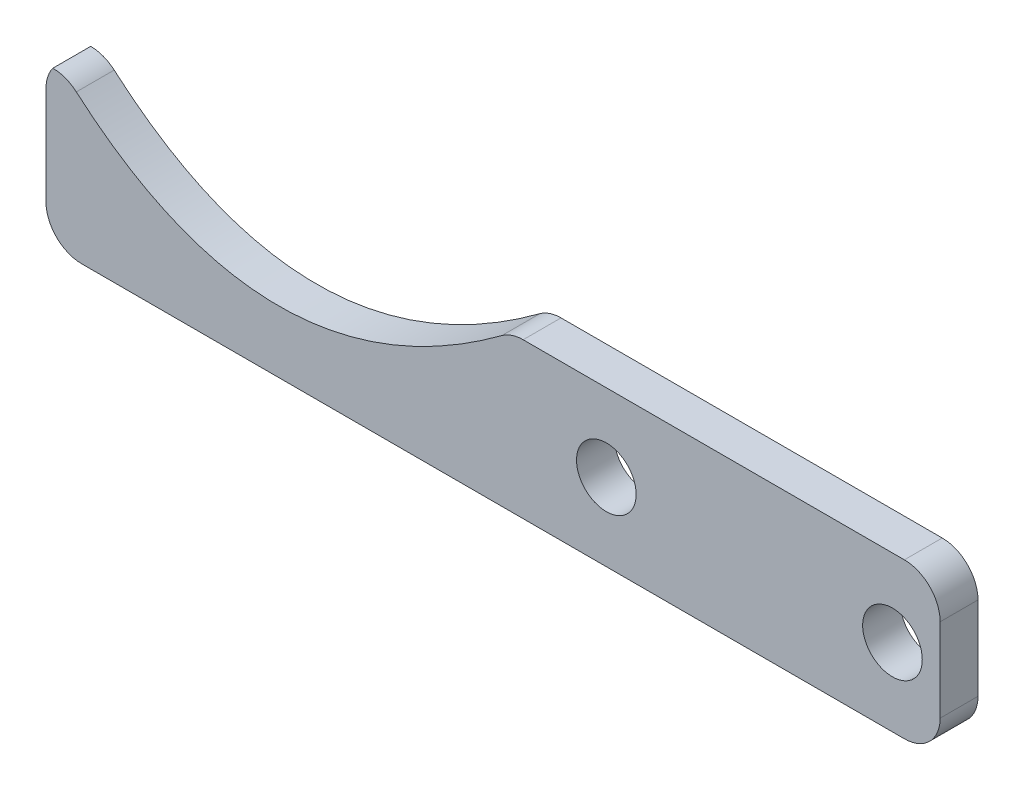
ISO-10303-21;
HEADER;
FILE_DESCRIPTION(('STEP AP214'),'2;1');
FILE_NAME('part.step','',(''),(''),'','','');
FILE_SCHEMA(('AUTOMOTIVE_DESIGN { 1 0 10303 214 1 1 1 1 }'));
ENDSEC;
DATA;
#1=APPLICATION_CONTEXT('core data for automotive mechanical design processes');
#2=APPLICATION_PROTOCOL_DEFINITION('international standard','automotive_design',2000,#1);
#3=PRODUCT_CONTEXT('',#1,'mechanical');
#4=PRODUCT('Part','Part','',(#3));
#5=PRODUCT_RELATED_PRODUCT_CATEGORY('part','',(#4));
#6=PRODUCT_DEFINITION_FORMATION('','',#4);
#7=PRODUCT_DEFINITION_CONTEXT('part definition',#1,'design');
#8=PRODUCT_DEFINITION('design','',#6,#7);
#9=PRODUCT_DEFINITION_SHAPE('','',#8);
#10=(LENGTH_UNIT() NAMED_UNIT(*) SI_UNIT(.MILLI.,.METRE.));
#11=(NAMED_UNIT(*) PLANE_ANGLE_UNIT() SI_UNIT($,.RADIAN.));
#12=(NAMED_UNIT(*) SI_UNIT($,.STERADIAN.) SOLID_ANGLE_UNIT());
#13=UNCERTAINTY_MEASURE_WITH_UNIT(LENGTH_MEASURE(1.E-05),#10,'distance_accuracy_value','');
#14=(GEOMETRIC_REPRESENTATION_CONTEXT(3) GLOBAL_UNCERTAINTY_ASSIGNED_CONTEXT((#13)) GLOBAL_UNIT_ASSIGNED_CONTEXT((#10,
#11,#12)) REPRESENTATION_CONTEXT('',''));
#15=CARTESIAN_POINT('',(0.,0.,0.));
#16=DIRECTION('',(0.,0.,1.));
#17=DIRECTION('',(1.,0.,0.));
#18=AXIS2_PLACEMENT_3D('',#15,#16,#17);
#19=CARTESIAN_POINT('',(37.5,6.49999999999999,3.175));
#20=DIRECTION('',(0.,0.,-1.));
#21=DIRECTION('',(-1.,0.,0.));
#22=AXIS2_PLACEMENT_3D('',#19,#20,#21);
#23=PLANE('',#22);
#24=CARTESIAN_POINT('',(33.5,0.,3.175));
#25=DIRECTION('',(0.,0.,1.));
#26=DIRECTION('',(1.,0.,0.));
#27=AXIS2_PLACEMENT_3D('',#24,#25,#26);
#28=CIRCLE('',#27,2.5);
#29=CARTESIAN_POINT('',(36.,0.,3.175));
#30=VERTEX_POINT('',#29);
#31=EDGE_CURVE('E285',#30,#30,#28,.T.);
#32=ORIENTED_EDGE('',*,*,#31,.F.);
#33=EDGE_LOOP('',(#32));
#34=FACE_BOUND('',#33,.T.);
#35=DIRECTION('',(1.,0.,0.));
#36=VECTOR('',#35,1.);
#37=CARTESIAN_POINT('',(-37.5,-6.50000000000001,3.175));
#38=LINE('',#37,#36);
#39=CARTESIAN_POINT('',(-34.5,-6.50000000000001,3.175));
#40=VERTEX_POINT('',#39);
#41=CARTESIAN_POINT('',(34.5,-6.50000000000001,3.175));
#42=VERTEX_POINT('',#41);
#43=EDGE_CURVE('E254',#40,#42,#38,.T.);
#44=ORIENTED_EDGE('',*,*,#43,.T.);
#45=CARTESIAN_POINT('',(34.5,-3.50000000000001,3.175));
#46=DIRECTION('',(0.,0.,-1.));
#47=DIRECTION('',(-1.,0.,0.));
#48=AXIS2_PLACEMENT_3D('',#45,#46,#47);
#49=CIRCLE('',#48,3.);
#50=CARTESIAN_POINT('',(37.5,-3.50000000000001,3.175));
#51=VERTEX_POINT('',#50);
#52=EDGE_CURVE('E225',#42,#51,#49,.F.);
#53=ORIENTED_EDGE('',*,*,#52,.T.);
#54=DIRECTION('',(0.,1.,0.));
#55=VECTOR('',#54,1.);
#56=CARTESIAN_POINT('',(37.5,-6.50000000000001,3.175));
#57=LINE('',#56,#55);
#58=CARTESIAN_POINT('',(37.5,3.49999999999999,3.175));
#59=VERTEX_POINT('',#58);
#60=EDGE_CURVE('E248',#51,#59,#57,.T.);
#61=ORIENTED_EDGE('',*,*,#60,.T.);
#62=CARTESIAN_POINT('',(34.5,3.49999999999999,3.175));
#63=DIRECTION('',(0.,0.,-1.));
#64=DIRECTION('',(-1.,0.,0.));
#65=AXIS2_PLACEMENT_3D('',#62,#63,#64);
#66=CIRCLE('',#65,3.);
#67=CARTESIAN_POINT('',(34.5,6.49999999999999,3.175));
#68=VERTEX_POINT('',#67);
#69=EDGE_CURVE('E48',#59,#68,#66,.F.);
#70=ORIENTED_EDGE('',*,*,#69,.T.);
#71=DIRECTION('',(-1.,0.,0.));
#72=VECTOR('',#71,1.);
#73=CARTESIAN_POINT('',(-37.5,6.50000000000001,3.175));
#74=LINE('',#73,#72);
#75=CARTESIAN_POINT('',(2.5234057065276,6.5,3.175));
#76=VERTEX_POINT('',#75);
#77=EDGE_CURVE('E291',#68,#76,#74,.T.);
#78=ORIENTED_EDGE('',*,*,#77,.T.);
#79=CARTESIAN_POINT('',(2.5234057065276,3.5,3.175));
#80=DIRECTION('',(0.,0.,-1.));
#81=DIRECTION('',(-1.,0.,0.));
#82=AXIS2_PLACEMENT_3D('',#79,#80,#81);
#83=CIRCLE('',#82,3.);
#84=CARTESIAN_POINT('',(0.739514180151453,5.91199730972557,3.175));
#85=VERTEX_POINT('',#84);
#86=EDGE_CURVE('E126',#76,#85,#83,.F.);
#87=ORIENTED_EDGE('',*,*,#86,.T.);
#88=CARTESIAN_POINT('',(-35.7803638417858,6.49999999999999,3.175));
#89=CARTESIAN_POINT('',(-18.824487266771,-9.09812396796002,3.175));
#90=CARTESIAN_POINT('',(1.52022512055479,6.49999999999999,3.175));
#91=B_SPLINE_CURVE_WITH_KNOTS('',2,(#88,#89,#90),.UNSPECIFIED.,.F.,.F.,(3,3),(0.,1.),.UNSPECIFIED.);
#92=CARTESIAN_POINT('',(-34.9563052857288,5.76209269875007,3.175));
#93=VERTEX_POINT('',#92);
#94=EDGE_CURVE('E132',#93,#85,#91,.T.);
#95=ORIENTED_EDGE('',*,*,#94,.F.);
#96=CARTESIAN_POINT('',(-36.926822127134,3.50000000000001,3.175));
#97=DIRECTION('',(0.,0.,-1.));
#98=DIRECTION('',(-1.,0.,0.));
#99=AXIS2_PLACEMENT_3D('',#96,#97,#98);
#100=CIRCLE('',#99,3.);
#101=CARTESIAN_POINT('',(-36.926822127134,6.50000000000001,3.175));
#102=VERTEX_POINT('',#101);
#103=EDGE_CURVE('E117',#93,#102,#100,.F.);
#104=ORIENTED_EDGE('',*,*,#103,.T.);
#105=CARTESIAN_POINT('',(-34.5,4.73632929285182,3.175));
#106=DIRECTION('',(0.,0.,-1.));
#107=DIRECTION('',(-1.,0.,0.));
#108=AXIS2_PLACEMENT_3D('',#105,#106,#107);
#109=CIRCLE('',#108,3.);
#110=CARTESIAN_POINT('',(-37.5,4.73632929285182,3.175));
#111=VERTEX_POINT('',#110);
#112=EDGE_CURVE('E223',#102,#111,#109,.F.);
#113=ORIENTED_EDGE('',*,*,#112,.T.);
#114=DIRECTION('',(0.,-1.,0.));
#115=VECTOR('',#114,1.);
#116=CARTESIAN_POINT('',(-37.5,-6.50000000000001,3.175));
#117=LINE('',#116,#115);
#118=CARTESIAN_POINT('',(-37.5,-3.50000000000001,3.175));
#119=VERTEX_POINT('',#118);
#120=EDGE_CURVE('E238',#111,#119,#117,.T.);
#121=ORIENTED_EDGE('',*,*,#120,.T.);
#122=CARTESIAN_POINT('',(-34.5,-3.50000000000001,3.175));
#123=DIRECTION('',(0.,0.,-1.));
#124=DIRECTION('',(-1.,0.,0.));
#125=AXIS2_PLACEMENT_3D('',#122,#123,#124);
#126=CIRCLE('',#125,3.);
#127=EDGE_CURVE('E219',#119,#40,#126,.F.);
#128=ORIENTED_EDGE('',*,*,#127,.T.);
#129=EDGE_LOOP('',(#44,#53,#61,#70,#78,#87,#95,#104,#113,#121,#128));
#130=FACE_BOUND('',#129,.T.);
#131=CARTESIAN_POINT('',(9.50000000000002,0.,3.175));
#132=DIRECTION('',(0.,0.,1.));
#133=DIRECTION('',(1.,0.,0.));
#134=AXIS2_PLACEMENT_3D('',#131,#132,#133);
#135=CIRCLE('',#134,2.5);
#136=CARTESIAN_POINT('',(12.,0.,3.175));
#137=VERTEX_POINT('',#136);
#138=EDGE_CURVE('E159',#137,#137,#135,.T.);
#139=ORIENTED_EDGE('',*,*,#138,.F.);
#140=EDGE_LOOP('',(#139));
#141=FACE_BOUND('',#140,.T.);
#142=ADVANCED_FACE('F33',(#34,#130,#141),#23,.F.);
#143=CARTESIAN_POINT('',(37.5,6.49999999999999,0.));
#144=DIRECTION('',(0.,0.,-1.));
#145=DIRECTION('',(-1.,0.,0.));
#146=AXIS2_PLACEMENT_3D('',#143,#144,#145);
#147=PLANE('',#146);
#148=DIRECTION('',(0.,1.,0.));
#149=VECTOR('',#148,1.);
#150=CARTESIAN_POINT('',(37.5,-6.50000000000001,0.));
#151=LINE('',#150,#149);
#152=CARTESIAN_POINT('',(37.5,-3.50000000000001,0.));
#153=VERTEX_POINT('',#152);
#154=CARTESIAN_POINT('',(37.5,3.49999999999999,0.));
#155=VERTEX_POINT('',#154);
#156=EDGE_CURVE('E250',#153,#155,#151,.T.);
#157=ORIENTED_EDGE('',*,*,#156,.F.);
#158=CARTESIAN_POINT('',(34.5,-3.50000000000001,0.));
#159=DIRECTION('',(0.,0.,-1.));
#160=DIRECTION('',(-1.,0.,0.));
#161=AXIS2_PLACEMENT_3D('',#158,#159,#160);
#162=CIRCLE('',#161,3.);
#163=CARTESIAN_POINT('',(34.5,-6.50000000000001,0.));
#164=VERTEX_POINT('',#163);
#165=EDGE_CURVE('E275',#153,#164,#162,.T.);
#166=ORIENTED_EDGE('',*,*,#165,.T.);
#167=DIRECTION('',(1.,0.,0.));
#168=VECTOR('',#167,1.);
#169=CARTESIAN_POINT('',(-37.5,-6.50000000000001,0.));
#170=LINE('',#169,#168);
#171=CARTESIAN_POINT('',(-34.5,-6.50000000000001,0.));
#172=VERTEX_POINT('',#171);
#173=EDGE_CURVE('E244',#172,#164,#170,.T.);
#174=ORIENTED_EDGE('',*,*,#173,.F.);
#175=CARTESIAN_POINT('',(-34.5,-3.50000000000001,0.));
#176=DIRECTION('',(0.,0.,-1.));
#177=DIRECTION('',(-1.,0.,0.));
#178=AXIS2_PLACEMENT_3D('',#175,#176,#177);
#179=CIRCLE('',#178,3.);
#180=CARTESIAN_POINT('',(-37.5,-3.50000000000001,0.));
#181=VERTEX_POINT('',#180);
#182=EDGE_CURVE('E243',#172,#181,#179,.T.);
#183=ORIENTED_EDGE('',*,*,#182,.T.);
#184=DIRECTION('',(0.,-1.,0.));
#185=VECTOR('',#184,1.);
#186=CARTESIAN_POINT('',(-37.5,-6.50000000000001,0.));
#187=LINE('',#186,#185);
#188=CARTESIAN_POINT('',(-37.5,4.73632929285182,0.));
#189=VERTEX_POINT('',#188);
#190=EDGE_CURVE('E237',#189,#181,#187,.T.);
#191=ORIENTED_EDGE('',*,*,#190,.F.);
#192=CARTESIAN_POINT('',(-34.5,4.73632929285182,0.));
#193=DIRECTION('',(0.,0.,-1.));
#194=DIRECTION('',(-1.,0.,0.));
#195=AXIS2_PLACEMENT_3D('',#192,#193,#194);
#196=CIRCLE('',#195,3.);
#197=CARTESIAN_POINT('',(-36.926822127134,6.50000000000001,0.));
#198=VERTEX_POINT('',#197);
#199=EDGE_CURVE('E241',#189,#198,#196,.T.);
#200=ORIENTED_EDGE('',*,*,#199,.T.);
#201=CARTESIAN_POINT('',(-36.926822127134,3.50000000000001,0.));
#202=DIRECTION('',(0.,0.,-1.));
#203=DIRECTION('',(-1.,0.,0.));
#204=AXIS2_PLACEMENT_3D('',#201,#202,#203);
#205=CIRCLE('',#204,3.);
#206=CARTESIAN_POINT('',(-34.9563052857288,5.76209269875007,0.));
#207=VERTEX_POINT('',#206);
#208=EDGE_CURVE('E261',#198,#207,#205,.T.);
#209=ORIENTED_EDGE('',*,*,#208,.T.);
#210=CARTESIAN_POINT('',(-35.7803638417858,6.49999999999999,0.));
#211=CARTESIAN_POINT('',(-18.824487266771,-9.09812396796002,0.));
#212=CARTESIAN_POINT('',(1.52022512055479,6.49999999999999,0.));
#213=B_SPLINE_CURVE_WITH_KNOTS('',2,(#210,#211,#212),.UNSPECIFIED.,.F.,.F.,(3,3),(0.,1.),.UNSPECIFIED.);
#214=CARTESIAN_POINT('',(0.739514180151453,5.91199730972557,0.));
#215=VERTEX_POINT('',#214);
#216=EDGE_CURVE('E135',#207,#215,#213,.T.);
#217=ORIENTED_EDGE('',*,*,#216,.T.);
#218=CARTESIAN_POINT('',(2.5234057065276,3.5,0.));
#219=DIRECTION('',(0.,0.,-1.));
#220=DIRECTION('',(-1.,0.,0.));
#221=AXIS2_PLACEMENT_3D('',#218,#219,#220);
#222=CIRCLE('',#221,3.);
#223=CARTESIAN_POINT('',(2.5234057065276,6.5,0.));
#224=VERTEX_POINT('',#223);
#225=EDGE_CURVE('E258',#215,#224,#222,.T.);
#226=ORIENTED_EDGE('',*,*,#225,.T.);
#227=DIRECTION('',(-1.,0.,0.));
#228=VECTOR('',#227,1.);
#229=CARTESIAN_POINT('',(-37.5,6.50000000000001,0.));
#230=LINE('',#229,#228);
#231=CARTESIAN_POINT('',(34.5,6.49999999999999,0.));
#232=VERTEX_POINT('',#231);
#233=EDGE_CURVE('E245',#232,#224,#230,.T.);
#234=ORIENTED_EDGE('',*,*,#233,.F.);
#235=CARTESIAN_POINT('',(34.5,3.49999999999999,0.));
#236=DIRECTION('',(0.,0.,-1.));
#237=DIRECTION('',(-1.,0.,0.));
#238=AXIS2_PLACEMENT_3D('',#235,#236,#237);
#239=CIRCLE('',#238,3.);
#240=EDGE_CURVE('E273',#232,#155,#239,.T.);
#241=ORIENTED_EDGE('',*,*,#240,.T.);
#242=EDGE_LOOP('',(#157,#166,#174,#183,#191,#200,#209,#217,#226,#234,#241));
#243=FACE_BOUND('',#242,.T.);
#244=CARTESIAN_POINT('',(33.5,0.,0.));
#245=DIRECTION('',(0.,0.,1.));
#246=DIRECTION('',(1.,0.,0.));
#247=AXIS2_PLACEMENT_3D('',#244,#245,#246);
#248=CIRCLE('',#247,2.5);
#249=CARTESIAN_POINT('',(36.,0.,0.));
#250=VERTEX_POINT('',#249);
#251=EDGE_CURVE('E287',#250,#250,#248,.T.);
#252=ORIENTED_EDGE('',*,*,#251,.T.);
#253=EDGE_LOOP('',(#252));
#254=FACE_BOUND('',#253,.T.);
#255=CARTESIAN_POINT('',(9.50000000000002,0.,0.));
#256=DIRECTION('',(0.,0.,1.));
#257=DIRECTION('',(1.,0.,0.));
#258=AXIS2_PLACEMENT_3D('',#255,#256,#257);
#259=CIRCLE('',#258,2.5);
#260=CARTESIAN_POINT('',(12.,0.,0.));
#261=VERTEX_POINT('',#260);
#262=EDGE_CURVE('E142',#261,#261,#259,.T.);
#263=ORIENTED_EDGE('',*,*,#262,.T.);
#264=EDGE_LOOP('',(#263));
#265=FACE_BOUND('',#264,.T.);
#266=ADVANCED_FACE('F178',(#243,#254,#265),#147,.T.);
#267=CARTESIAN_POINT('',(37.5,-6.50000000000001,3.175));
#268=DIRECTION('',(-1.,0.,0.));
#269=DIRECTION('',(0.,0.,1.));
#270=AXIS2_PLACEMENT_3D('',#267,#268,#269);
#271=PLANE('',#270);
#272=ORIENTED_EDGE('',*,*,#60,.F.);
#273=DIRECTION('',(0.,0.,-1.));
#274=VECTOR('',#273,1.);
#275=CARTESIAN_POINT('',(37.5,-3.50000000000001,3.175));
#276=LINE('',#275,#274);
#277=EDGE_CURVE('E268',#51,#153,#276,.T.);
#278=ORIENTED_EDGE('',*,*,#277,.T.);
#279=ORIENTED_EDGE('',*,*,#156,.T.);
#280=DIRECTION('',(0.,0.,-1.));
#281=VECTOR('',#280,1.);
#282=CARTESIAN_POINT('',(37.5,3.49999999999999,3.175));
#283=LINE('',#282,#281);
#284=EDGE_CURVE('E266',#155,#59,#283,.F.);
#285=ORIENTED_EDGE('',*,*,#284,.T.);
#286=EDGE_LOOP('',(#272,#278,#279,#285));
#287=FACE_BOUND('',#286,.T.);
#288=ADVANCED_FACE('F182',(#287),#271,.F.);
#289=CARTESIAN_POINT('',(-37.5,6.50000000000001,3.175));
#290=DIRECTION('',(0.,-1.,0.));
#291=DIRECTION('',(1.,0.,0.));
#292=AXIS2_PLACEMENT_3D('',#289,#290,#291);
#293=PLANE('',#292);
#294=ORIENTED_EDGE('',*,*,#77,.F.);
#295=DIRECTION('',(0.,0.,-1.));
#296=VECTOR('',#295,1.);
#297=CARTESIAN_POINT('',(34.5,6.49999999999999,3.175));
#298=LINE('',#297,#296);
#299=EDGE_CURVE('E232',#68,#232,#298,.T.);
#300=ORIENTED_EDGE('',*,*,#299,.T.);
#301=ORIENTED_EDGE('',*,*,#233,.T.);
#302=DIRECTION('',(0.,0.,1.));
#303=VECTOR('',#302,1.);
#304=CARTESIAN_POINT('',(2.5234057065276,6.5,3.175));
#305=LINE('',#304,#303);
#306=EDGE_CURVE('E263',#224,#76,#305,.T.);
#307=ORIENTED_EDGE('',*,*,#306,.T.);
#308=EDGE_LOOP('',(#294,#300,#301,#307));
#309=FACE_BOUND('',#308,.T.);
#310=ADVANCED_FACE('F190',(#309),#293,.F.);
#311=CARTESIAN_POINT('',(-37.5,-6.50000000000001,3.175));
#312=DIRECTION('',(1.,0.,0.));
#313=DIRECTION('',(0.,0.,-1.));
#314=AXIS2_PLACEMENT_3D('',#311,#312,#313);
#315=PLANE('',#314);
#316=ORIENTED_EDGE('',*,*,#190,.T.);
#317=DIRECTION('',(0.,0.,-1.));
#318=VECTOR('',#317,1.);
#319=CARTESIAN_POINT('',(-37.5,-3.50000000000001,3.175));
#320=LINE('',#319,#318);
#321=EDGE_CURVE('E11',#181,#119,#320,.F.);
#322=ORIENTED_EDGE('',*,*,#321,.T.);
#323=ORIENTED_EDGE('',*,*,#120,.F.);
#324=DIRECTION('',(0.,0.,1.));
#325=VECTOR('',#324,1.);
#326=CARTESIAN_POINT('',(-37.5,4.73632929285182,3.175));
#327=LINE('',#326,#325);
#328=EDGE_CURVE('E41',#111,#189,#327,.F.);
#329=ORIENTED_EDGE('',*,*,#328,.T.);
#330=EDGE_LOOP('',(#316,#322,#323,#329));
#331=FACE_BOUND('',#330,.T.);
#332=ADVANCED_FACE('F186',(#331),#315,.F.);
#333=CARTESIAN_POINT('',(-37.5,-6.50000000000001,3.175));
#334=DIRECTION('',(0.,1.,0.));
#335=DIRECTION('',(-1.,0.,0.));
#336=AXIS2_PLACEMENT_3D('',#333,#334,#335);
#337=PLANE('',#336);
#338=ORIENTED_EDGE('',*,*,#173,.T.);
#339=DIRECTION('',(0.,0.,-1.));
#340=VECTOR('',#339,1.);
#341=CARTESIAN_POINT('',(34.5,-6.50000000000001,3.175));
#342=LINE('',#341,#340);
#343=EDGE_CURVE('E227',#164,#42,#342,.F.);
#344=ORIENTED_EDGE('',*,*,#343,.T.);
#345=ORIENTED_EDGE('',*,*,#43,.F.);
#346=DIRECTION('',(0.,0.,-1.));
#347=VECTOR('',#346,1.);
#348=CARTESIAN_POINT('',(-34.5,-6.50000000000001,3.175));
#349=LINE('',#348,#347);
#350=EDGE_CURVE('E221',#40,#172,#349,.T.);
#351=ORIENTED_EDGE('',*,*,#350,.T.);
#352=EDGE_LOOP('',(#338,#344,#345,#351));
#353=FACE_BOUND('',#352,.T.);
#354=ADVANCED_FACE('F174',(#353),#337,.F.);
#355=CARTESIAN_POINT('',(33.5,0.,3.175));
#356=DIRECTION('',(0.,0.,-1.));
#357=DIRECTION('',(-1.,0.,0.));
#358=AXIS2_PLACEMENT_3D('',#355,#356,#357);
#359=CYLINDRICAL_SURFACE('',#358,2.5);
#360=ORIENTED_EDGE('',*,*,#31,.T.);
#361=EDGE_LOOP('',(#360));
#362=FACE_BOUND('',#361,.T.);
#363=ORIENTED_EDGE('',*,*,#251,.F.);
#364=EDGE_LOOP('',(#363));
#365=FACE_BOUND('',#364,.T.);
#366=ADVANCED_FACE('F170',(#362,#365),#359,.F.);
#367=CARTESIAN_POINT('',(9.50000000000002,0.,3.175));
#368=DIRECTION('',(0.,0.,-1.));
#369=DIRECTION('',(-1.,0.,0.));
#370=AXIS2_PLACEMENT_3D('',#367,#368,#369);
#371=CYLINDRICAL_SURFACE('',#370,2.5);
#372=ORIENTED_EDGE('',*,*,#138,.T.);
#373=EDGE_LOOP('',(#372));
#374=FACE_BOUND('',#373,.T.);
#375=ORIENTED_EDGE('',*,*,#262,.F.);
#376=EDGE_LOOP('',(#375));
#377=FACE_BOUND('',#376,.T.);
#378=ADVANCED_FACE('F167',(#374,#377),#371,.F.);
#379=CARTESIAN_POINT('',(-35.7803638417858,6.49999999999999,-38.1072080421467));
#380=CARTESIAN_POINT('',(-18.824487266771,-9.09812396796002,-38.1072080421467));
#381=CARTESIAN_POINT('',(1.52022512055479,6.49999999999999,-38.1072080421467));
#382=B_SPLINE_CURVE_WITH_KNOTS('',2,(#379,#380,#381),.UNSPECIFIED.,.F.,.F.,(3,3),(0.,1.),.UNSPECIFIED.);
#383=DIRECTION('',(0.,0.,1.));
#384=VECTOR('',#383,1.);
#385=SURFACE_OF_LINEAR_EXTRUSION('',#382,#384);
#386=ORIENTED_EDGE('',*,*,#216,.F.);
#387=DIRECTION('',(0.,0.,1.));
#388=VECTOR('',#387,1.);
#389=CARTESIAN_POINT('',(-34.9563052857288,5.76209269875007,0.));
#390=LINE('',#389,#388);
#391=EDGE_CURVE('E121',#207,#93,#390,.T.);
#392=ORIENTED_EDGE('',*,*,#391,.T.);
#393=ORIENTED_EDGE('',*,*,#94,.T.);
#394=DIRECTION('',(0.,0.,1.));
#395=VECTOR('',#394,1.);
#396=CARTESIAN_POINT('',(0.739514180147914,5.91199730972295,3.175));
#397=LINE('',#396,#395);
#398=EDGE_CURVE('E136',#85,#215,#397,.F.);
#399=ORIENTED_EDGE('',*,*,#398,.T.);
#400=EDGE_LOOP('',(#386,#392,#393,#399));
#401=FACE_BOUND('',#400,.T.);
#402=ADVANCED_FACE('F131',(#401),#385,.F.);
#403=CARTESIAN_POINT('',(-36.926822127134,3.50000000000001,1.58749999999998));
#404=DIRECTION('',(0.,0.,1.));
#405=DIRECTION('',(1.,0.,0.));
#406=AXIS2_PLACEMENT_3D('',#403,#404,#405);
#407=CYLINDRICAL_SURFACE('',#406,3.);
#408=ORIENTED_EDGE('',*,*,#208,.F.);
#409=DIRECTION('',(0.,0.,1.));
#410=VECTOR('',#409,1.);
#411=CARTESIAN_POINT('',(-36.926822127134,6.50000000000001,3.175));
#412=LINE('',#411,#410);
#413=EDGE_CURVE('E123',#102,#198,#412,.F.);
#414=ORIENTED_EDGE('',*,*,#413,.F.);
#415=ORIENTED_EDGE('',*,*,#103,.F.);
#416=ORIENTED_EDGE('',*,*,#391,.F.);
#417=EDGE_LOOP('',(#408,#414,#415,#416));
#418=FACE_BOUND('',#417,.T.);
#419=ADVANCED_FACE('F120',(#418),#407,.T.);
#420=CARTESIAN_POINT('',(2.5234057065276,3.5,1.5875));
#421=DIRECTION('',(0.,0.,1.));
#422=DIRECTION('',(1.,0.,0.));
#423=AXIS2_PLACEMENT_3D('',#420,#421,#422);
#424=CYLINDRICAL_SURFACE('',#423,3.);
#425=ORIENTED_EDGE('',*,*,#225,.F.);
#426=ORIENTED_EDGE('',*,*,#398,.F.);
#427=ORIENTED_EDGE('',*,*,#86,.F.);
#428=ORIENTED_EDGE('',*,*,#306,.F.);
#429=EDGE_LOOP('',(#425,#426,#427,#428));
#430=FACE_BOUND('',#429,.T.);
#431=ADVANCED_FACE('F199',(#430),#424,.T.);
#432=CARTESIAN_POINT('',(34.5,-3.50000000000001,3.175));
#433=DIRECTION('',(0.,0.,-1.));
#434=DIRECTION('',(-1.,0.,0.));
#435=AXIS2_PLACEMENT_3D('',#432,#433,#434);
#436=CYLINDRICAL_SURFACE('',#435,3.);
#437=ORIENTED_EDGE('',*,*,#52,.F.);
#438=ORIENTED_EDGE('',*,*,#343,.F.);
#439=ORIENTED_EDGE('',*,*,#165,.F.);
#440=ORIENTED_EDGE('',*,*,#277,.F.);
#441=EDGE_LOOP('',(#437,#438,#439,#440));
#442=FACE_BOUND('',#441,.T.);
#443=ADVANCED_FACE('F202',(#442),#436,.T.);
#444=CARTESIAN_POINT('',(34.5,3.49999999999999,3.175));
#445=DIRECTION('',(0.,0.,-1.));
#446=DIRECTION('',(-1.,0.,0.));
#447=AXIS2_PLACEMENT_3D('',#444,#445,#446);
#448=CYLINDRICAL_SURFACE('',#447,3.);
#449=ORIENTED_EDGE('',*,*,#69,.F.);
#450=ORIENTED_EDGE('',*,*,#284,.F.);
#451=ORIENTED_EDGE('',*,*,#240,.F.);
#452=ORIENTED_EDGE('',*,*,#299,.F.);
#453=EDGE_LOOP('',(#449,#450,#451,#452));
#454=FACE_BOUND('',#453,.T.);
#455=ADVANCED_FACE('F206',(#454),#448,.T.);
#456=CARTESIAN_POINT('',(-34.5,-3.50000000000001,3.175));
#457=DIRECTION('',(0.,0.,-1.));
#458=DIRECTION('',(-1.,0.,0.));
#459=AXIS2_PLACEMENT_3D('',#456,#457,#458);
#460=CYLINDRICAL_SURFACE('',#459,3.);
#461=ORIENTED_EDGE('',*,*,#127,.F.);
#462=ORIENTED_EDGE('',*,*,#321,.F.);
#463=ORIENTED_EDGE('',*,*,#182,.F.);
#464=ORIENTED_EDGE('',*,*,#350,.F.);
#465=EDGE_LOOP('',(#461,#462,#463,#464));
#466=FACE_BOUND('',#465,.T.);
#467=ADVANCED_FACE('F209',(#466),#460,.T.);
#468=CARTESIAN_POINT('',(-34.5,4.73632929285182,3.175));
#469=DIRECTION('',(0.,0.,1.));
#470=DIRECTION('',(1.,0.,0.));
#471=AXIS2_PLACEMENT_3D('',#468,#469,#470);
#472=CYLINDRICAL_SURFACE('',#471,3.);
#473=ORIENTED_EDGE('',*,*,#112,.F.);
#474=ORIENTED_EDGE('',*,*,#413,.T.);
#475=ORIENTED_EDGE('',*,*,#199,.F.);
#476=ORIENTED_EDGE('',*,*,#328,.F.);
#477=EDGE_LOOP('',(#473,#474,#475,#476));
#478=FACE_BOUND('',#477,.T.);
#479=ADVANCED_FACE('F35',(#478),#472,.T.);
#480=CLOSED_SHELL('',(#142,#266,#288,#310,#332,#354,#366,#378,#402,#419,#431,#443,#455,#467,#479));
#481=MANIFOLD_SOLID_BREP('B2',#480);
#482=ADVANCED_BREP_SHAPE_REPRESENTATION('',(#18,#481),#14);
#483=SHAPE_DEFINITION_REPRESENTATION(#9,#482);
ENDSEC;
END-ISO-10303-21;
